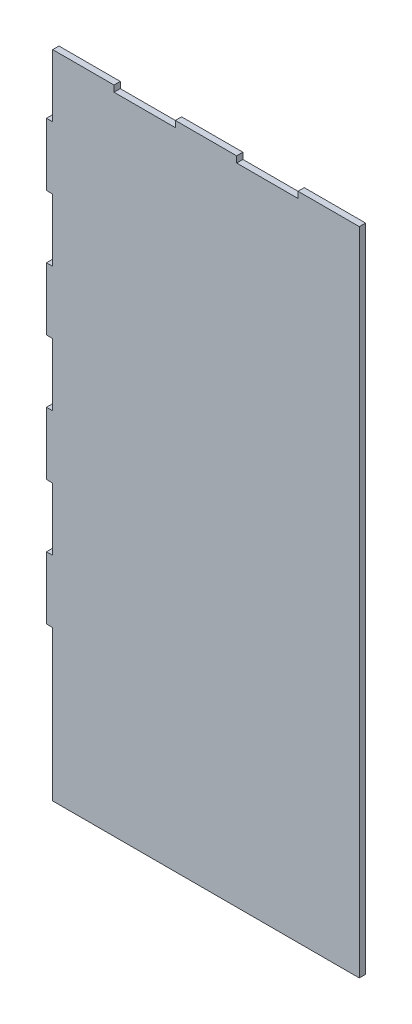
ISO-10303-21;
HEADER;
FILE_DESCRIPTION(('STEP AP214'),'2;1');
FILE_NAME('part.step','',(''),(''),'','','');
FILE_SCHEMA(('AUTOMOTIVE_DESIGN { 1 0 10303 214 1 1 1 1 }'));
ENDSEC;
DATA;
#1=APPLICATION_CONTEXT('core data for automotive mechanical design processes');
#2=APPLICATION_PROTOCOL_DEFINITION('international standard','automotive_design',2000,#1);
#3=PRODUCT_CONTEXT('',#1,'mechanical');
#4=PRODUCT('Part','Part','',(#3));
#5=PRODUCT_RELATED_PRODUCT_CATEGORY('part','',(#4));
#6=PRODUCT_DEFINITION_FORMATION('','',#4);
#7=PRODUCT_DEFINITION_CONTEXT('part definition',#1,'design');
#8=PRODUCT_DEFINITION('design','',#6,#7);
#9=PRODUCT_DEFINITION_SHAPE('','',#8);
#10=(LENGTH_UNIT() NAMED_UNIT(*) SI_UNIT(.MILLI.,.METRE.));
#11=(NAMED_UNIT(*) PLANE_ANGLE_UNIT() SI_UNIT($,.RADIAN.));
#12=(NAMED_UNIT(*) SI_UNIT($,.STERADIAN.) SOLID_ANGLE_UNIT());
#13=UNCERTAINTY_MEASURE_WITH_UNIT(LENGTH_MEASURE(1.E-05),#10,'distance_accuracy_value','');
#14=(GEOMETRIC_REPRESENTATION_CONTEXT(3) GLOBAL_UNCERTAINTY_ASSIGNED_CONTEXT((#13)) GLOBAL_UNIT_ASSIGNED_CONTEXT((#10,
#11,#12)) REPRESENTATION_CONTEXT('',''));
#15=CARTESIAN_POINT('',(0.,0.,0.));
#16=DIRECTION('',(0.,0.,1.));
#17=DIRECTION('',(1.,0.,0.));
#18=AXIS2_PLACEMENT_3D('',#15,#16,#17);
#19=CARTESIAN_POINT('',(0.,170.,5.));
#20=DIRECTION('',(0.,-1.,0.));
#21=DIRECTION('',(0.,0.,-1.));
#22=AXIS2_PLACEMENT_3D('',#19,#20,#21);
#23=PLANE('',#22);
#24=DIRECTION('',(-1.,0.,0.));
#25=VECTOR('',#24,1.);
#26=CARTESIAN_POINT('',(0.,170.,0.));
#27=LINE('',#26,#25);
#28=CARTESIAN_POINT('',(4.99999999999999,170.,0.));
#29=VERTEX_POINT('',#28);
#30=CARTESIAN_POINT('',(0.,170.,0.));
#31=VERTEX_POINT('',#30);
#32=EDGE_CURVE('E252',#29,#31,#27,.T.);
#33=ORIENTED_EDGE('',*,*,#32,.T.);
#34=DIRECTION('',(0.,0.,-1.));
#35=VECTOR('',#34,1.);
#36=CARTESIAN_POINT('',(0.,170.,5.));
#37=LINE('',#36,#35);
#38=CARTESIAN_POINT('',(0.,170.,5.));
#39=VERTEX_POINT('',#38);
#40=EDGE_CURVE('E11',#39,#31,#37,.T.);
#41=ORIENTED_EDGE('',*,*,#40,.F.);
#42=DIRECTION('',(-1.,0.,0.));
#43=VECTOR('',#42,1.);
#44=CARTESIAN_POINT('',(0.,170.,5.));
#45=LINE('',#44,#43);
#46=CARTESIAN_POINT('',(4.99999999999999,170.,5.));
#47=VERTEX_POINT('',#46);
#48=EDGE_CURVE('E306',#47,#39,#45,.T.);
#49=ORIENTED_EDGE('',*,*,#48,.F.);
#50=DIRECTION('',(0.,0.,-1.));
#51=VECTOR('',#50,1.);
#52=CARTESIAN_POINT('',(4.99999999999999,170.,5.));
#53=LINE('',#52,#51);
#54=EDGE_CURVE('E248',#47,#29,#53,.T.);
#55=ORIENTED_EDGE('',*,*,#54,.T.);
#56=EDGE_LOOP('',(#33,#41,#49,#55));
#57=FACE_BOUND('',#56,.T.);
#58=ADVANCED_FACE('F36',(#57),#23,.F.);
#59=CARTESIAN_POINT('',(0.,120.,5.));
#60=DIRECTION('',(1.,0.,0.));
#61=DIRECTION('',(0.,0.,-1.));
#62=AXIS2_PLACEMENT_3D('',#59,#60,#61);
#63=PLANE('',#62);
#64=DIRECTION('',(0.,-1.,0.));
#65=VECTOR('',#64,1.);
#66=CARTESIAN_POINT('',(0.,120.,0.));
#67=LINE('',#66,#65);
#68=CARTESIAN_POINT('',(0.,120.,0.));
#69=VERTEX_POINT('',#68);
#70=EDGE_CURVE('E255',#31,#69,#67,.T.);
#71=ORIENTED_EDGE('',*,*,#70,.T.);
#72=DIRECTION('',(0.,0.,-1.));
#73=VECTOR('',#72,1.);
#74=CARTESIAN_POINT('',(0.,120.,5.));
#75=LINE('',#74,#73);
#76=CARTESIAN_POINT('',(0.,120.,5.));
#77=VERTEX_POINT('',#76);
#78=EDGE_CURVE('E44',#77,#69,#75,.T.);
#79=ORIENTED_EDGE('',*,*,#78,.F.);
#80=DIRECTION('',(0.,-1.,0.));
#81=VECTOR('',#80,1.);
#82=CARTESIAN_POINT('',(0.,120.,5.));
#83=LINE('',#82,#81);
#84=EDGE_CURVE('E155',#39,#77,#83,.T.);
#85=ORIENTED_EDGE('',*,*,#84,.F.);
#86=ORIENTED_EDGE('',*,*,#40,.T.);
#87=EDGE_LOOP('',(#71,#79,#85,#86));
#88=FACE_BOUND('',#87,.T.);
#89=ADVANCED_FACE('F464',(#88),#63,.F.);
#90=CARTESIAN_POINT('',(0.,120.,5.));
#91=DIRECTION('',(0.,1.,0.));
#92=DIRECTION('',(0.,0.,1.));
#93=AXIS2_PLACEMENT_3D('',#90,#91,#92);
#94=PLANE('',#93);
#95=DIRECTION('',(1.,0.,0.));
#96=VECTOR('',#95,1.);
#97=CARTESIAN_POINT('',(0.,120.,0.));
#98=LINE('',#97,#96);
#99=CARTESIAN_POINT('',(4.99999999999999,120.,0.));
#100=VERTEX_POINT('',#99);
#101=EDGE_CURVE('E257',#69,#100,#98,.T.);
#102=ORIENTED_EDGE('',*,*,#101,.T.);
#103=DIRECTION('',(0.,0.,-1.));
#104=VECTOR('',#103,1.);
#105=CARTESIAN_POINT('',(4.99999999999999,120.,5.));
#106=LINE('',#105,#104);
#107=CARTESIAN_POINT('',(4.99999999999999,120.,5.));
#108=VERTEX_POINT('',#107);
#109=EDGE_CURVE('E373',#108,#100,#106,.T.);
#110=ORIENTED_EDGE('',*,*,#109,.F.);
#111=DIRECTION('',(1.,0.,0.));
#112=VECTOR('',#111,1.);
#113=CARTESIAN_POINT('',(0.,120.,5.));
#114=LINE('',#113,#112);
#115=EDGE_CURVE('E381',#77,#108,#114,.T.);
#116=ORIENTED_EDGE('',*,*,#115,.F.);
#117=ORIENTED_EDGE('',*,*,#78,.T.);
#118=EDGE_LOOP('',(#102,#110,#116,#117));
#119=FACE_BOUND('',#118,.T.);
#120=ADVANCED_FACE('F379',(#119),#94,.F.);
#121=CARTESIAN_POINT('',(4.99999999999999,120.,5.));
#122=DIRECTION('',(1.,0.,0.));
#123=DIRECTION('',(0.,1.,0.));
#124=AXIS2_PLACEMENT_3D('',#121,#122,#123);
#125=PLANE('',#124);
#126=DIRECTION('',(0.,-1.,0.));
#127=VECTOR('',#126,1.);
#128=CARTESIAN_POINT('',(4.99999999999999,120.,0.));
#129=LINE('',#128,#127);
#130=CARTESIAN_POINT('',(5.,0.,0.));
#131=VERTEX_POINT('',#130);
#132=EDGE_CURVE('E259',#100,#131,#129,.T.);
#133=ORIENTED_EDGE('',*,*,#132,.T.);
#134=DIRECTION('',(0.,0.,-1.));
#135=VECTOR('',#134,1.);
#136=CARTESIAN_POINT('',(5.,0.,5.));
#137=LINE('',#136,#135);
#138=CARTESIAN_POINT('',(5.,0.,5.));
#139=VERTEX_POINT('',#138);
#140=EDGE_CURVE('E370',#139,#131,#137,.T.);
#141=ORIENTED_EDGE('',*,*,#140,.F.);
#142=DIRECTION('',(0.,-1.,0.));
#143=VECTOR('',#142,1.);
#144=CARTESIAN_POINT('',(4.99999999999999,120.,5.));
#145=LINE('',#144,#143);
#146=EDGE_CURVE('E399',#108,#139,#145,.T.);
#147=ORIENTED_EDGE('',*,*,#146,.F.);
#148=ORIENTED_EDGE('',*,*,#109,.T.);
#149=EDGE_LOOP('',(#133,#141,#147,#148));
#150=FACE_BOUND('',#149,.T.);
#151=ADVANCED_FACE('F390',(#150),#125,.F.);
#152=CARTESIAN_POINT('',(250.,0.,5.));
#153=DIRECTION('',(0.,1.,0.));
#154=DIRECTION('',(-1.,0.,0.));
#155=AXIS2_PLACEMENT_3D('',#152,#153,#154);
#156=PLANE('',#155);
#157=DIRECTION('',(1.,0.,0.));
#158=VECTOR('',#157,1.);
#159=CARTESIAN_POINT('',(250.,0.,0.));
#160=LINE('',#159,#158);
#161=CARTESIAN_POINT('',(250.,0.,0.));
#162=VERTEX_POINT('',#161);
#163=EDGE_CURVE('E261',#131,#162,#160,.T.);
#164=ORIENTED_EDGE('',*,*,#163,.T.);
#165=DIRECTION('',(0.,0.,-1.));
#166=VECTOR('',#165,1.);
#167=CARTESIAN_POINT('',(250.,0.,5.));
#168=LINE('',#167,#166);
#169=CARTESIAN_POINT('',(250.,0.,5.));
#170=VERTEX_POINT('',#169);
#171=EDGE_CURVE('E367',#170,#162,#168,.T.);
#172=ORIENTED_EDGE('',*,*,#171,.F.);
#173=DIRECTION('',(1.,0.,0.));
#174=VECTOR('',#173,1.);
#175=CARTESIAN_POINT('',(250.,0.,5.));
#176=LINE('',#175,#174);
#177=EDGE_CURVE('E396',#139,#170,#176,.T.);
#178=ORIENTED_EDGE('',*,*,#177,.F.);
#179=ORIENTED_EDGE('',*,*,#140,.T.);
#180=EDGE_LOOP('',(#164,#172,#178,#179));
#181=FACE_BOUND('',#180,.T.);
#182=ADVANCED_FACE('F394',(#181),#156,.F.);
#183=CARTESIAN_POINT('',(250.,0.,5.));
#184=DIRECTION('',(-1.,0.,0.));
#185=DIRECTION('',(0.,0.,1.));
#186=AXIS2_PLACEMENT_3D('',#183,#184,#185);
#187=PLANE('',#186);
#188=DIRECTION('',(0.,1.,0.));
#189=VECTOR('',#188,1.);
#190=CARTESIAN_POINT('',(250.,0.,0.));
#191=LINE('',#190,#189);
#192=CARTESIAN_POINT('',(250.,520.,0.));
#193=VERTEX_POINT('',#192);
#194=EDGE_CURVE('E263',#162,#193,#191,.T.);
#195=ORIENTED_EDGE('',*,*,#194,.T.);
#196=DIRECTION('',(0.,0.,-1.));
#197=VECTOR('',#196,1.);
#198=CARTESIAN_POINT('',(250.,520.,5.));
#199=LINE('',#198,#197);
#200=CARTESIAN_POINT('',(250.,520.,5.));
#201=VERTEX_POINT('',#200);
#202=EDGE_CURVE('E364',#201,#193,#199,.T.);
#203=ORIENTED_EDGE('',*,*,#202,.F.);
#204=DIRECTION('',(0.,1.,0.));
#205=VECTOR('',#204,1.);
#206=CARTESIAN_POINT('',(250.,0.,5.));
#207=LINE('',#206,#205);
#208=EDGE_CURVE('E398',#170,#201,#207,.T.);
#209=ORIENTED_EDGE('',*,*,#208,.F.);
#210=ORIENTED_EDGE('',*,*,#171,.T.);
#211=EDGE_LOOP('',(#195,#203,#209,#210));
#212=FACE_BOUND('',#211,.T.);
#213=ADVANCED_FACE('F477',(#212),#187,.F.);
#214=CARTESIAN_POINT('',(201.,520.,5.));
#215=DIRECTION('',(0.,-1.,0.));
#216=DIRECTION('',(0.,0.,-1.));
#217=AXIS2_PLACEMENT_3D('',#214,#215,#216);
#218=PLANE('',#217);
#219=DIRECTION('',(-1.,0.,0.));
#220=VECTOR('',#219,1.);
#221=CARTESIAN_POINT('',(201.,520.,0.));
#222=LINE('',#221,#220);
#223=CARTESIAN_POINT('',(201.,520.,0.));
#224=VERTEX_POINT('',#223);
#225=EDGE_CURVE('E265',#193,#224,#222,.T.);
#226=ORIENTED_EDGE('',*,*,#225,.T.);
#227=DIRECTION('',(0.,0.,-1.));
#228=VECTOR('',#227,1.);
#229=CARTESIAN_POINT('',(201.,520.,5.));
#230=LINE('',#229,#228);
#231=CARTESIAN_POINT('',(201.,520.,5.));
#232=VERTEX_POINT('',#231);
#233=EDGE_CURVE('E361',#232,#224,#230,.T.);
#234=ORIENTED_EDGE('',*,*,#233,.F.);
#235=DIRECTION('',(-1.,0.,0.));
#236=VECTOR('',#235,1.);
#237=CARTESIAN_POINT('',(201.,520.,5.));
#238=LINE('',#237,#236);
#239=EDGE_CURVE('E401',#201,#232,#238,.T.);
#240=ORIENTED_EDGE('',*,*,#239,.F.);
#241=ORIENTED_EDGE('',*,*,#202,.T.);
#242=EDGE_LOOP('',(#226,#234,#240,#241));
#243=FACE_BOUND('',#242,.T.);
#244=ADVANCED_FACE('F480',(#243),#218,.F.);
#245=CARTESIAN_POINT('',(201.,515.,5.));
#246=DIRECTION('',(1.,0.,0.));
#247=DIRECTION('',(0.,0.,-1.));
#248=AXIS2_PLACEMENT_3D('',#245,#246,#247);
#249=PLANE('',#248);
#250=DIRECTION('',(0.,-1.,0.));
#251=VECTOR('',#250,1.);
#252=CARTESIAN_POINT('',(201.,515.,0.));
#253=LINE('',#252,#251);
#254=CARTESIAN_POINT('',(201.,515.,0.));
#255=VERTEX_POINT('',#254);
#256=EDGE_CURVE('E267',#224,#255,#253,.T.);
#257=ORIENTED_EDGE('',*,*,#256,.T.);
#258=DIRECTION('',(0.,0.,-1.));
#259=VECTOR('',#258,1.);
#260=CARTESIAN_POINT('',(201.,515.,5.));
#261=LINE('',#260,#259);
#262=CARTESIAN_POINT('',(201.,515.,5.));
#263=VERTEX_POINT('',#262);
#264=EDGE_CURVE('E358',#263,#255,#261,.T.);
#265=ORIENTED_EDGE('',*,*,#264,.F.);
#266=DIRECTION('',(0.,-1.,0.));
#267=VECTOR('',#266,1.);
#268=CARTESIAN_POINT('',(201.,515.,5.));
#269=LINE('',#268,#267);
#270=EDGE_CURVE('E407',#232,#263,#269,.T.);
#271=ORIENTED_EDGE('',*,*,#270,.F.);
#272=ORIENTED_EDGE('',*,*,#233,.T.);
#273=EDGE_LOOP('',(#257,#265,#271,#272));
#274=FACE_BOUND('',#273,.T.);
#275=ADVANCED_FACE('F484',(#274),#249,.F.);
#276=CARTESIAN_POINT('',(152.,515.,5.));
#277=DIRECTION('',(0.,-1.,0.));
#278=DIRECTION('',(0.,0.,-1.));
#279=AXIS2_PLACEMENT_3D('',#276,#277,#278);
#280=PLANE('',#279);
#281=DIRECTION('',(-1.,0.,0.));
#282=VECTOR('',#281,1.);
#283=CARTESIAN_POINT('',(152.,515.,0.));
#284=LINE('',#283,#282);
#285=CARTESIAN_POINT('',(152.,515.,0.));
#286=VERTEX_POINT('',#285);
#287=EDGE_CURVE('E269',#255,#286,#284,.T.);
#288=ORIENTED_EDGE('',*,*,#287,.T.);
#289=DIRECTION('',(0.,0.,-1.));
#290=VECTOR('',#289,1.);
#291=CARTESIAN_POINT('',(152.,515.,5.));
#292=LINE('',#291,#290);
#293=CARTESIAN_POINT('',(152.,515.,5.));
#294=VERTEX_POINT('',#293);
#295=EDGE_CURVE('E355',#294,#286,#292,.T.);
#296=ORIENTED_EDGE('',*,*,#295,.F.);
#297=DIRECTION('',(-1.,0.,0.));
#298=VECTOR('',#297,1.);
#299=CARTESIAN_POINT('',(152.,515.,5.));
#300=LINE('',#299,#298);
#301=EDGE_CURVE('E409',#263,#294,#300,.T.);
#302=ORIENTED_EDGE('',*,*,#301,.F.);
#303=ORIENTED_EDGE('',*,*,#264,.T.);
#304=EDGE_LOOP('',(#288,#296,#302,#303));
#305=FACE_BOUND('',#304,.T.);
#306=ADVANCED_FACE('F488',(#305),#280,.F.);
#307=CARTESIAN_POINT('',(152.,520.,5.));
#308=DIRECTION('',(-1.,0.,0.));
#309=DIRECTION('',(0.,0.,1.));
#310=AXIS2_PLACEMENT_3D('',#307,#308,#309);
#311=PLANE('',#310);
#312=DIRECTION('',(0.,1.,0.));
#313=VECTOR('',#312,1.);
#314=CARTESIAN_POINT('',(152.,520.,0.));
#315=LINE('',#314,#313);
#316=CARTESIAN_POINT('',(152.,520.,0.));
#317=VERTEX_POINT('',#316);
#318=EDGE_CURVE('E271',#286,#317,#315,.T.);
#319=ORIENTED_EDGE('',*,*,#318,.T.);
#320=DIRECTION('',(0.,0.,-1.));
#321=VECTOR('',#320,1.);
#322=CARTESIAN_POINT('',(152.,520.,5.));
#323=LINE('',#322,#321);
#324=CARTESIAN_POINT('',(152.,520.,5.));
#325=VERTEX_POINT('',#324);
#326=EDGE_CURVE('E352',#325,#317,#323,.T.);
#327=ORIENTED_EDGE('',*,*,#326,.F.);
#328=DIRECTION('',(0.,1.,0.));
#329=VECTOR('',#328,1.);
#330=CARTESIAN_POINT('',(152.,520.,5.));
#331=LINE('',#330,#329);
#332=EDGE_CURVE('E411',#294,#325,#331,.T.);
#333=ORIENTED_EDGE('',*,*,#332,.F.);
#334=ORIENTED_EDGE('',*,*,#295,.T.);
#335=EDGE_LOOP('',(#319,#327,#333,#334));
#336=FACE_BOUND('',#335,.T.);
#337=ADVANCED_FACE('F492',(#336),#311,.F.);
#338=CARTESIAN_POINT('',(103.,520.,5.));
#339=DIRECTION('',(0.,-1.,0.));
#340=DIRECTION('',(0.,0.,-1.));
#341=AXIS2_PLACEMENT_3D('',#338,#339,#340);
#342=PLANE('',#341);
#343=DIRECTION('',(-1.,0.,0.));
#344=VECTOR('',#343,1.);
#345=CARTESIAN_POINT('',(103.,520.,0.));
#346=LINE('',#345,#344);
#347=CARTESIAN_POINT('',(103.,520.,0.));
#348=VERTEX_POINT('',#347);
#349=EDGE_CURVE('E273',#317,#348,#346,.T.);
#350=ORIENTED_EDGE('',*,*,#349,.T.);
#351=DIRECTION('',(0.,0.,-1.));
#352=VECTOR('',#351,1.);
#353=CARTESIAN_POINT('',(103.,520.,5.));
#354=LINE('',#353,#352);
#355=CARTESIAN_POINT('',(103.,520.,5.));
#356=VERTEX_POINT('',#355);
#357=EDGE_CURVE('E349',#356,#348,#354,.T.);
#358=ORIENTED_EDGE('',*,*,#357,.F.);
#359=DIRECTION('',(-1.,0.,0.));
#360=VECTOR('',#359,1.);
#361=CARTESIAN_POINT('',(103.,520.,5.));
#362=LINE('',#361,#360);
#363=EDGE_CURVE('E413',#325,#356,#362,.T.);
#364=ORIENTED_EDGE('',*,*,#363,.F.);
#365=ORIENTED_EDGE('',*,*,#326,.T.);
#366=EDGE_LOOP('',(#350,#358,#364,#365));
#367=FACE_BOUND('',#366,.T.);
#368=ADVANCED_FACE('F496',(#367),#342,.F.);
#369=CARTESIAN_POINT('',(103.,515.,5.));
#370=DIRECTION('',(1.,0.,0.));
#371=DIRECTION('',(0.,0.,-1.));
#372=AXIS2_PLACEMENT_3D('',#369,#370,#371);
#373=PLANE('',#372);
#374=DIRECTION('',(0.,-1.,0.));
#375=VECTOR('',#374,1.);
#376=CARTESIAN_POINT('',(103.,515.,0.));
#377=LINE('',#376,#375);
#378=CARTESIAN_POINT('',(103.,515.,0.));
#379=VERTEX_POINT('',#378);
#380=EDGE_CURVE('E275',#348,#379,#377,.T.);
#381=ORIENTED_EDGE('',*,*,#380,.T.);
#382=DIRECTION('',(0.,0.,-1.));
#383=VECTOR('',#382,1.);
#384=CARTESIAN_POINT('',(103.,515.,5.));
#385=LINE('',#384,#383);
#386=CARTESIAN_POINT('',(103.,515.,5.));
#387=VERTEX_POINT('',#386);
#388=EDGE_CURVE('E346',#387,#379,#385,.T.);
#389=ORIENTED_EDGE('',*,*,#388,.F.);
#390=DIRECTION('',(0.,-1.,0.));
#391=VECTOR('',#390,1.);
#392=CARTESIAN_POINT('',(103.,515.,5.));
#393=LINE('',#392,#391);
#394=EDGE_CURVE('E415',#356,#387,#393,.T.);
#395=ORIENTED_EDGE('',*,*,#394,.F.);
#396=ORIENTED_EDGE('',*,*,#357,.T.);
#397=EDGE_LOOP('',(#381,#389,#395,#396));
#398=FACE_BOUND('',#397,.T.);
#399=ADVANCED_FACE('F500',(#398),#373,.F.);
#400=CARTESIAN_POINT('',(54.,515.,5.));
#401=DIRECTION('',(0.,-1.,0.));
#402=DIRECTION('',(0.,0.,-1.));
#403=AXIS2_PLACEMENT_3D('',#400,#401,#402);
#404=PLANE('',#403);
#405=DIRECTION('',(-1.,0.,0.));
#406=VECTOR('',#405,1.);
#407=CARTESIAN_POINT('',(54.,515.,0.));
#408=LINE('',#407,#406);
#409=CARTESIAN_POINT('',(54.,515.,0.));
#410=VERTEX_POINT('',#409);
#411=EDGE_CURVE('E277',#379,#410,#408,.T.);
#412=ORIENTED_EDGE('',*,*,#411,.T.);
#413=DIRECTION('',(0.,0.,-1.));
#414=VECTOR('',#413,1.);
#415=CARTESIAN_POINT('',(54.,515.,5.));
#416=LINE('',#415,#414);
#417=CARTESIAN_POINT('',(54.,515.,5.));
#418=VERTEX_POINT('',#417);
#419=EDGE_CURVE('E343',#418,#410,#416,.T.);
#420=ORIENTED_EDGE('',*,*,#419,.F.);
#421=DIRECTION('',(-1.,0.,0.));
#422=VECTOR('',#421,1.);
#423=CARTESIAN_POINT('',(54.,515.,5.));
#424=LINE('',#423,#422);
#425=EDGE_CURVE('E417',#387,#418,#424,.T.);
#426=ORIENTED_EDGE('',*,*,#425,.F.);
#427=ORIENTED_EDGE('',*,*,#388,.T.);
#428=EDGE_LOOP('',(#412,#420,#426,#427));
#429=FACE_BOUND('',#428,.T.);
#430=ADVANCED_FACE('F504',(#429),#404,.F.);
#431=CARTESIAN_POINT('',(54.,520.,5.));
#432=DIRECTION('',(-1.,0.,0.));
#433=DIRECTION('',(0.,0.,1.));
#434=AXIS2_PLACEMENT_3D('',#431,#432,#433);
#435=PLANE('',#434);
#436=DIRECTION('',(0.,1.,0.));
#437=VECTOR('',#436,1.);
#438=CARTESIAN_POINT('',(54.,520.,0.));
#439=LINE('',#438,#437);
#440=CARTESIAN_POINT('',(54.,520.,0.));
#441=VERTEX_POINT('',#440);
#442=EDGE_CURVE('E279',#410,#441,#439,.T.);
#443=ORIENTED_EDGE('',*,*,#442,.T.);
#444=DIRECTION('',(0.,0.,-1.));
#445=VECTOR('',#444,1.);
#446=CARTESIAN_POINT('',(54.,520.,5.));
#447=LINE('',#446,#445);
#448=CARTESIAN_POINT('',(54.,520.,5.));
#449=VERTEX_POINT('',#448);
#450=EDGE_CURVE('E340',#449,#441,#447,.T.);
#451=ORIENTED_EDGE('',*,*,#450,.F.);
#452=DIRECTION('',(0.,1.,0.));
#453=VECTOR('',#452,1.);
#454=CARTESIAN_POINT('',(54.,520.,5.));
#455=LINE('',#454,#453);
#456=EDGE_CURVE('E419',#418,#449,#455,.T.);
#457=ORIENTED_EDGE('',*,*,#456,.F.);
#458=ORIENTED_EDGE('',*,*,#419,.T.);
#459=EDGE_LOOP('',(#443,#451,#457,#458));
#460=FACE_BOUND('',#459,.T.);
#461=ADVANCED_FACE('F508',(#460),#435,.F.);
#462=CARTESIAN_POINT('',(4.99999999999996,520.,5.));
#463=DIRECTION('',(0.,-1.,0.));
#464=DIRECTION('',(0.,0.,-1.));
#465=AXIS2_PLACEMENT_3D('',#462,#463,#464);
#466=PLANE('',#465);
#467=DIRECTION('',(-1.,0.,0.));
#468=VECTOR('',#467,1.);
#469=CARTESIAN_POINT('',(4.99999999999996,520.,0.));
#470=LINE('',#469,#468);
#471=CARTESIAN_POINT('',(4.99999999999996,520.,0.));
#472=VERTEX_POINT('',#471);
#473=EDGE_CURVE('E281',#441,#472,#470,.T.);
#474=ORIENTED_EDGE('',*,*,#473,.T.);
#475=DIRECTION('',(0.,0.,-1.));
#476=VECTOR('',#475,1.);
#477=CARTESIAN_POINT('',(4.99999999999996,520.,5.));
#478=LINE('',#477,#476);
#479=CARTESIAN_POINT('',(4.99999999999996,520.,5.));
#480=VERTEX_POINT('',#479);
#481=EDGE_CURVE('E337',#480,#472,#478,.T.);
#482=ORIENTED_EDGE('',*,*,#481,.F.);
#483=DIRECTION('',(-1.,0.,0.));
#484=VECTOR('',#483,1.);
#485=CARTESIAN_POINT('',(4.99999999999996,520.,5.));
#486=LINE('',#485,#484);
#487=EDGE_CURVE('E421',#449,#480,#486,.T.);
#488=ORIENTED_EDGE('',*,*,#487,.F.);
#489=ORIENTED_EDGE('',*,*,#450,.T.);
#490=EDGE_LOOP('',(#474,#482,#488,#489));
#491=FACE_BOUND('',#490,.T.);
#492=ADVANCED_FACE('F512',(#491),#466,.F.);
#493=CARTESIAN_POINT('',(4.99999999999999,470.,5.));
#494=DIRECTION('',(1.,0.,0.));
#495=DIRECTION('',(0.,1.,0.));
#496=AXIS2_PLACEMENT_3D('',#493,#494,#495);
#497=PLANE('',#496);
#498=DIRECTION('',(0.,-1.,0.));
#499=VECTOR('',#498,1.);
#500=CARTESIAN_POINT('',(4.99999999999999,470.,0.));
#501=LINE('',#500,#499);
#502=CARTESIAN_POINT('',(4.99999999999999,470.,0.));
#503=VERTEX_POINT('',#502);
#504=EDGE_CURVE('E283',#472,#503,#501,.T.);
#505=ORIENTED_EDGE('',*,*,#504,.T.);
#506=DIRECTION('',(0.,0.,-1.));
#507=VECTOR('',#506,1.);
#508=CARTESIAN_POINT('',(4.99999999999999,470.,5.));
#509=LINE('',#508,#507);
#510=CARTESIAN_POINT('',(4.99999999999999,470.,5.));
#511=VERTEX_POINT('',#510);
#512=EDGE_CURVE('E334',#511,#503,#509,.T.);
#513=ORIENTED_EDGE('',*,*,#512,.F.);
#514=DIRECTION('',(0.,-1.,0.));
#515=VECTOR('',#514,1.);
#516=CARTESIAN_POINT('',(4.99999999999999,470.,5.));
#517=LINE('',#516,#515);
#518=EDGE_CURVE('E423',#480,#511,#517,.T.);
#519=ORIENTED_EDGE('',*,*,#518,.F.);
#520=ORIENTED_EDGE('',*,*,#481,.T.);
#521=EDGE_LOOP('',(#505,#513,#519,#520));
#522=FACE_BOUND('',#521,.T.);
#523=ADVANCED_FACE('F516',(#522),#497,.F.);
#524=CARTESIAN_POINT('',(0.,470.,5.));
#525=DIRECTION('',(0.,-1.,0.));
#526=DIRECTION('',(0.,0.,-1.));
#527=AXIS2_PLACEMENT_3D('',#524,#525,#526);
#528=PLANE('',#527);
#529=DIRECTION('',(-1.,0.,0.));
#530=VECTOR('',#529,1.);
#531=CARTESIAN_POINT('',(0.,470.,0.));
#532=LINE('',#531,#530);
#533=CARTESIAN_POINT('',(0.,470.,0.));
#534=VERTEX_POINT('',#533);
#535=EDGE_CURVE('E285',#503,#534,#532,.T.);
#536=ORIENTED_EDGE('',*,*,#535,.T.);
#537=DIRECTION('',(0.,0.,-1.));
#538=VECTOR('',#537,1.);
#539=CARTESIAN_POINT('',(0.,470.,5.));
#540=LINE('',#539,#538);
#541=CARTESIAN_POINT('',(0.,470.,5.));
#542=VERTEX_POINT('',#541);
#543=EDGE_CURVE('E331',#542,#534,#540,.T.);
#544=ORIENTED_EDGE('',*,*,#543,.F.);
#545=DIRECTION('',(-1.,0.,0.));
#546=VECTOR('',#545,1.);
#547=CARTESIAN_POINT('',(0.,470.,5.));
#548=LINE('',#547,#546);
#549=EDGE_CURVE('E425',#511,#542,#548,.T.);
#550=ORIENTED_EDGE('',*,*,#549,.F.);
#551=ORIENTED_EDGE('',*,*,#512,.T.);
#552=EDGE_LOOP('',(#536,#544,#550,#551));
#553=FACE_BOUND('',#552,.T.);
#554=ADVANCED_FACE('F520',(#553),#528,.F.);
#555=CARTESIAN_POINT('',(0.,420.,5.));
#556=DIRECTION('',(1.,0.,0.));
#557=DIRECTION('',(0.,0.,-1.));
#558=AXIS2_PLACEMENT_3D('',#555,#556,#557);
#559=PLANE('',#558);
#560=DIRECTION('',(0.,-1.,0.));
#561=VECTOR('',#560,1.);
#562=CARTESIAN_POINT('',(0.,420.,0.));
#563=LINE('',#562,#561);
#564=CARTESIAN_POINT('',(0.,420.,0.));
#565=VERTEX_POINT('',#564);
#566=EDGE_CURVE('E287',#534,#565,#563,.T.);
#567=ORIENTED_EDGE('',*,*,#566,.T.);
#568=DIRECTION('',(0.,0.,-1.));
#569=VECTOR('',#568,1.);
#570=CARTESIAN_POINT('',(0.,420.,5.));
#571=LINE('',#570,#569);
#572=CARTESIAN_POINT('',(0.,420.,5.));
#573=VERTEX_POINT('',#572);
#574=EDGE_CURVE('E328',#573,#565,#571,.T.);
#575=ORIENTED_EDGE('',*,*,#574,.F.);
#576=DIRECTION('',(0.,-1.,0.));
#577=VECTOR('',#576,1.);
#578=CARTESIAN_POINT('',(0.,420.,5.));
#579=LINE('',#578,#577);
#580=EDGE_CURVE('E427',#542,#573,#579,.T.);
#581=ORIENTED_EDGE('',*,*,#580,.F.);
#582=ORIENTED_EDGE('',*,*,#543,.T.);
#583=EDGE_LOOP('',(#567,#575,#581,#582));
#584=FACE_BOUND('',#583,.T.);
#585=ADVANCED_FACE('F524',(#584),#559,.F.);
#586=CARTESIAN_POINT('',(4.99999999999999,420.,5.));
#587=DIRECTION('',(0.,1.,0.));
#588=DIRECTION('',(0.,0.,1.));
#589=AXIS2_PLACEMENT_3D('',#586,#587,#588);
#590=PLANE('',#589);
#591=DIRECTION('',(1.,0.,0.));
#592=VECTOR('',#591,1.);
#593=CARTESIAN_POINT('',(4.99999999999999,420.,0.));
#594=LINE('',#593,#592);
#595=CARTESIAN_POINT('',(4.99999999999999,420.,0.));
#596=VERTEX_POINT('',#595);
#597=EDGE_CURVE('E289',#565,#596,#594,.T.);
#598=ORIENTED_EDGE('',*,*,#597,.T.);
#599=DIRECTION('',(0.,0.,-1.));
#600=VECTOR('',#599,1.);
#601=CARTESIAN_POINT('',(4.99999999999999,420.,5.));
#602=LINE('',#601,#600);
#603=CARTESIAN_POINT('',(4.99999999999999,420.,5.));
#604=VERTEX_POINT('',#603);
#605=EDGE_CURVE('E325',#604,#596,#602,.T.);
#606=ORIENTED_EDGE('',*,*,#605,.F.);
#607=DIRECTION('',(1.,0.,0.));
#608=VECTOR('',#607,1.);
#609=CARTESIAN_POINT('',(4.99999999999999,420.,5.));
#610=LINE('',#609,#608);
#611=EDGE_CURVE('E429',#573,#604,#610,.T.);
#612=ORIENTED_EDGE('',*,*,#611,.F.);
#613=ORIENTED_EDGE('',*,*,#574,.T.);
#614=EDGE_LOOP('',(#598,#606,#612,#613));
#615=FACE_BOUND('',#614,.T.);
#616=ADVANCED_FACE('F528',(#615),#590,.F.);
#617=CARTESIAN_POINT('',(4.99999999999999,370.,5.));
#618=DIRECTION('',(1.,0.,0.));
#619=DIRECTION('',(0.,0.,-1.));
#620=AXIS2_PLACEMENT_3D('',#617,#618,#619);
#621=PLANE('',#620);
#622=DIRECTION('',(0.,-1.,0.));
#623=VECTOR('',#622,1.);
#624=CARTESIAN_POINT('',(4.99999999999999,370.,0.));
#625=LINE('',#624,#623);
#626=CARTESIAN_POINT('',(4.99999999999999,370.,0.));
#627=VERTEX_POINT('',#626);
#628=EDGE_CURVE('E291',#596,#627,#625,.T.);
#629=ORIENTED_EDGE('',*,*,#628,.T.);
#630=DIRECTION('',(0.,0.,-1.));
#631=VECTOR('',#630,1.);
#632=CARTESIAN_POINT('',(4.99999999999999,370.,5.));
#633=LINE('',#632,#631);
#634=CARTESIAN_POINT('',(4.99999999999999,370.,5.));
#635=VERTEX_POINT('',#634);
#636=EDGE_CURVE('E322',#635,#627,#633,.T.);
#637=ORIENTED_EDGE('',*,*,#636,.F.);
#638=DIRECTION('',(0.,-1.,0.));
#639=VECTOR('',#638,1.);
#640=CARTESIAN_POINT('',(4.99999999999999,370.,5.));
#641=LINE('',#640,#639);
#642=EDGE_CURVE('E431',#604,#635,#641,.T.);
#643=ORIENTED_EDGE('',*,*,#642,.F.);
#644=ORIENTED_EDGE('',*,*,#605,.T.);
#645=EDGE_LOOP('',(#629,#637,#643,#644));
#646=FACE_BOUND('',#645,.T.);
#647=ADVANCED_FACE('F532',(#646),#621,.F.);
#648=CARTESIAN_POINT('',(0.,370.,5.));
#649=DIRECTION('',(0.,-1.,0.));
#650=DIRECTION('',(0.,0.,-1.));
#651=AXIS2_PLACEMENT_3D('',#648,#649,#650);
#652=PLANE('',#651);
#653=DIRECTION('',(-1.,0.,0.));
#654=VECTOR('',#653,1.);
#655=CARTESIAN_POINT('',(0.,370.,0.));
#656=LINE('',#655,#654);
#657=CARTESIAN_POINT('',(0.,370.,0.));
#658=VERTEX_POINT('',#657);
#659=EDGE_CURVE('E293',#627,#658,#656,.T.);
#660=ORIENTED_EDGE('',*,*,#659,.T.);
#661=DIRECTION('',(0.,0.,-1.));
#662=VECTOR('',#661,1.);
#663=CARTESIAN_POINT('',(0.,370.,5.));
#664=LINE('',#663,#662);
#665=CARTESIAN_POINT('',(0.,370.,5.));
#666=VERTEX_POINT('',#665);
#667=EDGE_CURVE('E319',#666,#658,#664,.T.);
#668=ORIENTED_EDGE('',*,*,#667,.F.);
#669=DIRECTION('',(-1.,0.,0.));
#670=VECTOR('',#669,1.);
#671=CARTESIAN_POINT('',(0.,370.,5.));
#672=LINE('',#671,#670);
#673=EDGE_CURVE('E433',#635,#666,#672,.T.);
#674=ORIENTED_EDGE('',*,*,#673,.F.);
#675=ORIENTED_EDGE('',*,*,#636,.T.);
#676=EDGE_LOOP('',(#660,#668,#674,#675));
#677=FACE_BOUND('',#676,.T.);
#678=ADVANCED_FACE('F536',(#677),#652,.F.);
#679=CARTESIAN_POINT('',(0.,320.,5.));
#680=DIRECTION('',(1.,0.,0.));
#681=DIRECTION('',(0.,0.,-1.));
#682=AXIS2_PLACEMENT_3D('',#679,#680,#681);
#683=PLANE('',#682);
#684=DIRECTION('',(0.,-1.,0.));
#685=VECTOR('',#684,1.);
#686=CARTESIAN_POINT('',(0.,320.,0.));
#687=LINE('',#686,#685);
#688=CARTESIAN_POINT('',(0.,320.,0.));
#689=VERTEX_POINT('',#688);
#690=EDGE_CURVE('E295',#658,#689,#687,.T.);
#691=ORIENTED_EDGE('',*,*,#690,.T.);
#692=DIRECTION('',(0.,0.,-1.));
#693=VECTOR('',#692,1.);
#694=CARTESIAN_POINT('',(0.,320.,5.));
#695=LINE('',#694,#693);
#696=CARTESIAN_POINT('',(0.,320.,5.));
#697=VERTEX_POINT('',#696);
#698=EDGE_CURVE('E316',#697,#689,#695,.T.);
#699=ORIENTED_EDGE('',*,*,#698,.F.);
#700=DIRECTION('',(0.,-1.,0.));
#701=VECTOR('',#700,1.);
#702=CARTESIAN_POINT('',(0.,320.,5.));
#703=LINE('',#702,#701);
#704=EDGE_CURVE('E435',#666,#697,#703,.T.);
#705=ORIENTED_EDGE('',*,*,#704,.F.);
#706=ORIENTED_EDGE('',*,*,#667,.T.);
#707=EDGE_LOOP('',(#691,#699,#705,#706));
#708=FACE_BOUND('',#707,.T.);
#709=ADVANCED_FACE('F540',(#708),#683,.F.);
#710=CARTESIAN_POINT('',(4.99999999999999,320.,5.));
#711=DIRECTION('',(0.,1.,0.));
#712=DIRECTION('',(0.,0.,1.));
#713=AXIS2_PLACEMENT_3D('',#710,#711,#712);
#714=PLANE('',#713);
#715=DIRECTION('',(1.,0.,0.));
#716=VECTOR('',#715,1.);
#717=CARTESIAN_POINT('',(4.99999999999999,320.,0.));
#718=LINE('',#717,#716);
#719=CARTESIAN_POINT('',(4.99999999999999,320.,0.));
#720=VERTEX_POINT('',#719);
#721=EDGE_CURVE('E297',#689,#720,#718,.T.);
#722=ORIENTED_EDGE('',*,*,#721,.T.);
#723=DIRECTION('',(0.,0.,-1.));
#724=VECTOR('',#723,1.);
#725=CARTESIAN_POINT('',(4.99999999999999,320.,5.));
#726=LINE('',#725,#724);
#727=CARTESIAN_POINT('',(4.99999999999999,320.,5.));
#728=VERTEX_POINT('',#727);
#729=EDGE_CURVE('E313',#728,#720,#726,.T.);
#730=ORIENTED_EDGE('',*,*,#729,.F.);
#731=DIRECTION('',(1.,0.,0.));
#732=VECTOR('',#731,1.);
#733=CARTESIAN_POINT('',(4.99999999999999,320.,5.));
#734=LINE('',#733,#732);
#735=EDGE_CURVE('E437',#697,#728,#734,.T.);
#736=ORIENTED_EDGE('',*,*,#735,.F.);
#737=ORIENTED_EDGE('',*,*,#698,.T.);
#738=EDGE_LOOP('',(#722,#730,#736,#737));
#739=FACE_BOUND('',#738,.T.);
#740=ADVANCED_FACE('F544',(#739),#714,.F.);
#741=CARTESIAN_POINT('',(4.99999999999999,270.,5.));
#742=DIRECTION('',(1.,0.,0.));
#743=DIRECTION('',(0.,0.,-1.));
#744=AXIS2_PLACEMENT_3D('',#741,#742,#743);
#745=PLANE('',#744);
#746=DIRECTION('',(0.,-1.,0.));
#747=VECTOR('',#746,1.);
#748=CARTESIAN_POINT('',(4.99999999999999,270.,0.));
#749=LINE('',#748,#747);
#750=CARTESIAN_POINT('',(4.99999999999999,270.,0.));
#751=VERTEX_POINT('',#750);
#752=EDGE_CURVE('E299',#720,#751,#749,.T.);
#753=ORIENTED_EDGE('',*,*,#752,.T.);
#754=DIRECTION('',(0.,0.,-1.));
#755=VECTOR('',#754,1.);
#756=CARTESIAN_POINT('',(4.99999999999999,270.,5.));
#757=LINE('',#756,#755);
#758=CARTESIAN_POINT('',(4.99999999999999,270.,5.));
#759=VERTEX_POINT('',#758);
#760=EDGE_CURVE('E310',#759,#751,#757,.T.);
#761=ORIENTED_EDGE('',*,*,#760,.F.);
#762=DIRECTION('',(0.,-1.,0.));
#763=VECTOR('',#762,1.);
#764=CARTESIAN_POINT('',(4.99999999999999,270.,5.));
#765=LINE('',#764,#763);
#766=EDGE_CURVE('E439',#728,#759,#765,.T.);
#767=ORIENTED_EDGE('',*,*,#766,.F.);
#768=ORIENTED_EDGE('',*,*,#729,.T.);
#769=EDGE_LOOP('',(#753,#761,#767,#768));
#770=FACE_BOUND('',#769,.T.);
#771=ADVANCED_FACE('F445',(#770),#745,.F.);
#772=CARTESIAN_POINT('',(0.,270.,5.));
#773=DIRECTION('',(0.,-1.,0.));
#774=DIRECTION('',(0.,0.,-1.));
#775=AXIS2_PLACEMENT_3D('',#772,#773,#774);
#776=PLANE('',#775);
#777=DIRECTION('',(-1.,0.,0.));
#778=VECTOR('',#777,1.);
#779=CARTESIAN_POINT('',(0.,270.,0.));
#780=LINE('',#779,#778);
#781=CARTESIAN_POINT('',(0.,270.,0.));
#782=VERTEX_POINT('',#781);
#783=EDGE_CURVE('E301',#751,#782,#780,.T.);
#784=ORIENTED_EDGE('',*,*,#783,.T.);
#785=DIRECTION('',(0.,0.,-1.));
#786=VECTOR('',#785,1.);
#787=CARTESIAN_POINT('',(0.,270.,5.));
#788=LINE('',#787,#786);
#789=CARTESIAN_POINT('',(0.,270.,5.));
#790=VERTEX_POINT('',#789);
#791=EDGE_CURVE('E243',#790,#782,#788,.T.);
#792=ORIENTED_EDGE('',*,*,#791,.F.);
#793=DIRECTION('',(-1.,0.,0.));
#794=VECTOR('',#793,1.);
#795=CARTESIAN_POINT('',(0.,270.,5.));
#796=LINE('',#795,#794);
#797=EDGE_CURVE('E234',#759,#790,#796,.T.);
#798=ORIENTED_EDGE('',*,*,#797,.F.);
#799=ORIENTED_EDGE('',*,*,#760,.T.);
#800=EDGE_LOOP('',(#784,#792,#798,#799));
#801=FACE_BOUND('',#800,.T.);
#802=ADVANCED_FACE('F449',(#801),#776,.F.);
#803=CARTESIAN_POINT('',(0.,220.,5.));
#804=DIRECTION('',(1.,0.,0.));
#805=DIRECTION('',(0.,0.,-1.));
#806=AXIS2_PLACEMENT_3D('',#803,#804,#805);
#807=PLANE('',#806);
#808=DIRECTION('',(0.,-1.,0.));
#809=VECTOR('',#808,1.);
#810=CARTESIAN_POINT('',(0.,220.,0.));
#811=LINE('',#810,#809);
#812=CARTESIAN_POINT('',(0.,220.,0.));
#813=VERTEX_POINT('',#812);
#814=EDGE_CURVE('E242',#782,#813,#811,.T.);
#815=ORIENTED_EDGE('',*,*,#814,.T.);
#816=DIRECTION('',(0.,0.,-1.));
#817=VECTOR('',#816,1.);
#818=CARTESIAN_POINT('',(0.,220.,5.));
#819=LINE('',#818,#817);
#820=CARTESIAN_POINT('',(0.,220.,5.));
#821=VERTEX_POINT('',#820);
#822=EDGE_CURVE('E239',#821,#813,#819,.T.);
#823=ORIENTED_EDGE('',*,*,#822,.F.);
#824=DIRECTION('',(0.,-1.,0.));
#825=VECTOR('',#824,1.);
#826=CARTESIAN_POINT('',(0.,220.,5.));
#827=LINE('',#826,#825);
#828=EDGE_CURVE('E228',#790,#821,#827,.T.);
#829=ORIENTED_EDGE('',*,*,#828,.F.);
#830=ORIENTED_EDGE('',*,*,#791,.T.);
#831=EDGE_LOOP('',(#815,#823,#829,#830));
#832=FACE_BOUND('',#831,.T.);
#833=ADVANCED_FACE('F240',(#832),#807,.F.);
#834=CARTESIAN_POINT('',(4.99999999999999,220.,5.));
#835=DIRECTION('',(0.,1.,0.));
#836=DIRECTION('',(0.,0.,1.));
#837=AXIS2_PLACEMENT_3D('',#834,#835,#836);
#838=PLANE('',#837);
#839=DIRECTION('',(1.,0.,0.));
#840=VECTOR('',#839,1.);
#841=CARTESIAN_POINT('',(4.99999999999999,220.,0.));
#842=LINE('',#841,#840);
#843=CARTESIAN_POINT('',(4.99999999999999,220.,0.));
#844=VERTEX_POINT('',#843);
#845=EDGE_CURVE('E141',#813,#844,#842,.T.);
#846=ORIENTED_EDGE('',*,*,#845,.T.);
#847=DIRECTION('',(0.,0.,-1.));
#848=VECTOR('',#847,1.);
#849=CARTESIAN_POINT('',(4.99999999999999,220.,5.));
#850=LINE('',#849,#848);
#851=CARTESIAN_POINT('',(4.99999999999999,220.,5.));
#852=VERTEX_POINT('',#851);
#853=EDGE_CURVE('E244',#852,#844,#850,.T.);
#854=ORIENTED_EDGE('',*,*,#853,.F.);
#855=DIRECTION('',(1.,0.,0.));
#856=VECTOR('',#855,1.);
#857=CARTESIAN_POINT('',(4.99999999999999,220.,5.));
#858=LINE('',#857,#856);
#859=EDGE_CURVE('E232',#821,#852,#858,.T.);
#860=ORIENTED_EDGE('',*,*,#859,.F.);
#861=ORIENTED_EDGE('',*,*,#822,.T.);
#862=EDGE_LOOP('',(#846,#854,#860,#861));
#863=FACE_BOUND('',#862,.T.);
#864=ADVANCED_FACE('F246',(#863),#838,.F.);
#865=CARTESIAN_POINT('',(4.99999999999999,170.,5.));
#866=DIRECTION('',(1.,0.,0.));
#867=DIRECTION('',(0.,0.,-1.));
#868=AXIS2_PLACEMENT_3D('',#865,#866,#867);
#869=PLANE('',#868);
#870=DIRECTION('',(0.,-1.,0.));
#871=VECTOR('',#870,1.);
#872=CARTESIAN_POINT('',(4.99999999999999,170.,0.));
#873=LINE('',#872,#871);
#874=EDGE_CURVE('E147',#844,#29,#873,.T.);
#875=ORIENTED_EDGE('',*,*,#874,.T.);
#876=ORIENTED_EDGE('',*,*,#54,.F.);
#877=DIRECTION('',(0.,-1.,0.));
#878=VECTOR('',#877,1.);
#879=CARTESIAN_POINT('',(4.99999999999999,170.,5.));
#880=LINE('',#879,#878);
#881=EDGE_CURVE('E52',#852,#47,#880,.T.);
#882=ORIENTED_EDGE('',*,*,#881,.F.);
#883=ORIENTED_EDGE('',*,*,#853,.T.);
#884=EDGE_LOOP('',(#875,#876,#882,#883));
#885=FACE_BOUND('',#884,.T.);
#886=ADVANCED_FACE('F453',(#885),#869,.F.);
#887=CARTESIAN_POINT('',(0.,0.,5.));
#888=DIRECTION('',(0.,0.,1.));
#889=DIRECTION('',(1.,0.,0.));
#890=AXIS2_PLACEMENT_3D('',#887,#888,#889);
#891=PLANE('',#890);
#892=ORIENTED_EDGE('',*,*,#48,.T.);
#893=ORIENTED_EDGE('',*,*,#84,.T.);
#894=ORIENTED_EDGE('',*,*,#115,.T.);
#895=ORIENTED_EDGE('',*,*,#146,.T.);
#896=ORIENTED_EDGE('',*,*,#177,.T.);
#897=ORIENTED_EDGE('',*,*,#208,.T.);
#898=ORIENTED_EDGE('',*,*,#239,.T.);
#899=ORIENTED_EDGE('',*,*,#270,.T.);
#900=ORIENTED_EDGE('',*,*,#301,.T.);
#901=ORIENTED_EDGE('',*,*,#332,.T.);
#902=ORIENTED_EDGE('',*,*,#363,.T.);
#903=ORIENTED_EDGE('',*,*,#394,.T.);
#904=ORIENTED_EDGE('',*,*,#425,.T.);
#905=ORIENTED_EDGE('',*,*,#456,.T.);
#906=ORIENTED_EDGE('',*,*,#487,.T.);
#907=ORIENTED_EDGE('',*,*,#518,.T.);
#908=ORIENTED_EDGE('',*,*,#549,.T.);
#909=ORIENTED_EDGE('',*,*,#580,.T.);
#910=ORIENTED_EDGE('',*,*,#611,.T.);
#911=ORIENTED_EDGE('',*,*,#642,.T.);
#912=ORIENTED_EDGE('',*,*,#673,.T.);
#913=ORIENTED_EDGE('',*,*,#704,.T.);
#914=ORIENTED_EDGE('',*,*,#735,.T.);
#915=ORIENTED_EDGE('',*,*,#766,.T.);
#916=ORIENTED_EDGE('',*,*,#797,.T.);
#917=ORIENTED_EDGE('',*,*,#828,.T.);
#918=ORIENTED_EDGE('',*,*,#859,.T.);
#919=ORIENTED_EDGE('',*,*,#881,.T.);
#920=EDGE_LOOP('',(#892,#893,#894,#895,#896,#897,#898,#899,#900,#901,#902,#903,#904,#905,#906,
#907,#908,#909,#910,#911,#912,#913,#914,#915,#916,#917,#918,#919));
#921=FACE_BOUND('',#920,.T.);
#922=ADVANCED_FACE('F230',(#921),#891,.T.);
#923=CARTESIAN_POINT('',(0.,0.,0.));
#924=DIRECTION('',(0.,0.,1.));
#925=DIRECTION('',(1.,0.,0.));
#926=AXIS2_PLACEMENT_3D('',#923,#924,#925);
#927=PLANE('',#926);
#928=ORIENTED_EDGE('',*,*,#32,.F.);
#929=ORIENTED_EDGE('',*,*,#874,.F.);
#930=ORIENTED_EDGE('',*,*,#845,.F.);
#931=ORIENTED_EDGE('',*,*,#814,.F.);
#932=ORIENTED_EDGE('',*,*,#783,.F.);
#933=ORIENTED_EDGE('',*,*,#752,.F.);
#934=ORIENTED_EDGE('',*,*,#721,.F.);
#935=ORIENTED_EDGE('',*,*,#690,.F.);
#936=ORIENTED_EDGE('',*,*,#659,.F.);
#937=ORIENTED_EDGE('',*,*,#628,.F.);
#938=ORIENTED_EDGE('',*,*,#597,.F.);
#939=ORIENTED_EDGE('',*,*,#566,.F.);
#940=ORIENTED_EDGE('',*,*,#535,.F.);
#941=ORIENTED_EDGE('',*,*,#504,.F.);
#942=ORIENTED_EDGE('',*,*,#473,.F.);
#943=ORIENTED_EDGE('',*,*,#442,.F.);
#944=ORIENTED_EDGE('',*,*,#411,.F.);
#945=ORIENTED_EDGE('',*,*,#380,.F.);
#946=ORIENTED_EDGE('',*,*,#349,.F.);
#947=ORIENTED_EDGE('',*,*,#318,.F.);
#948=ORIENTED_EDGE('',*,*,#287,.F.);
#949=ORIENTED_EDGE('',*,*,#256,.F.);
#950=ORIENTED_EDGE('',*,*,#225,.F.);
#951=ORIENTED_EDGE('',*,*,#194,.F.);
#952=ORIENTED_EDGE('',*,*,#163,.F.);
#953=ORIENTED_EDGE('',*,*,#132,.F.);
#954=ORIENTED_EDGE('',*,*,#101,.F.);
#955=ORIENTED_EDGE('',*,*,#70,.F.);
#956=EDGE_LOOP('',(#928,#929,#930,#931,#932,#933,#934,#935,#936,#937,#938,#939,#940,#941,#942,
#943,#944,#945,#946,#947,#948,#949,#950,#951,#952,#953,#954,#955));
#957=FACE_BOUND('',#956,.T.);
#958=ADVANCED_FACE('F385',(#957),#927,.F.);
#959=CLOSED_SHELL('',(#58,#89,#120,#151,#182,#213,#244,#275,#306,#337,#368,#399,#430,#461,#492,
#523,#554,#585,#616,#647,#678,#709,#740,#771,#802,#833,#864,#886,#922,#958));
#960=MANIFOLD_SOLID_BREP('B2',#959);
#961=ADVANCED_BREP_SHAPE_REPRESENTATION('',(#18,#960),#14);
#962=SHAPE_DEFINITION_REPRESENTATION(#9,#961);
ENDSEC;
END-ISO-10303-21;
